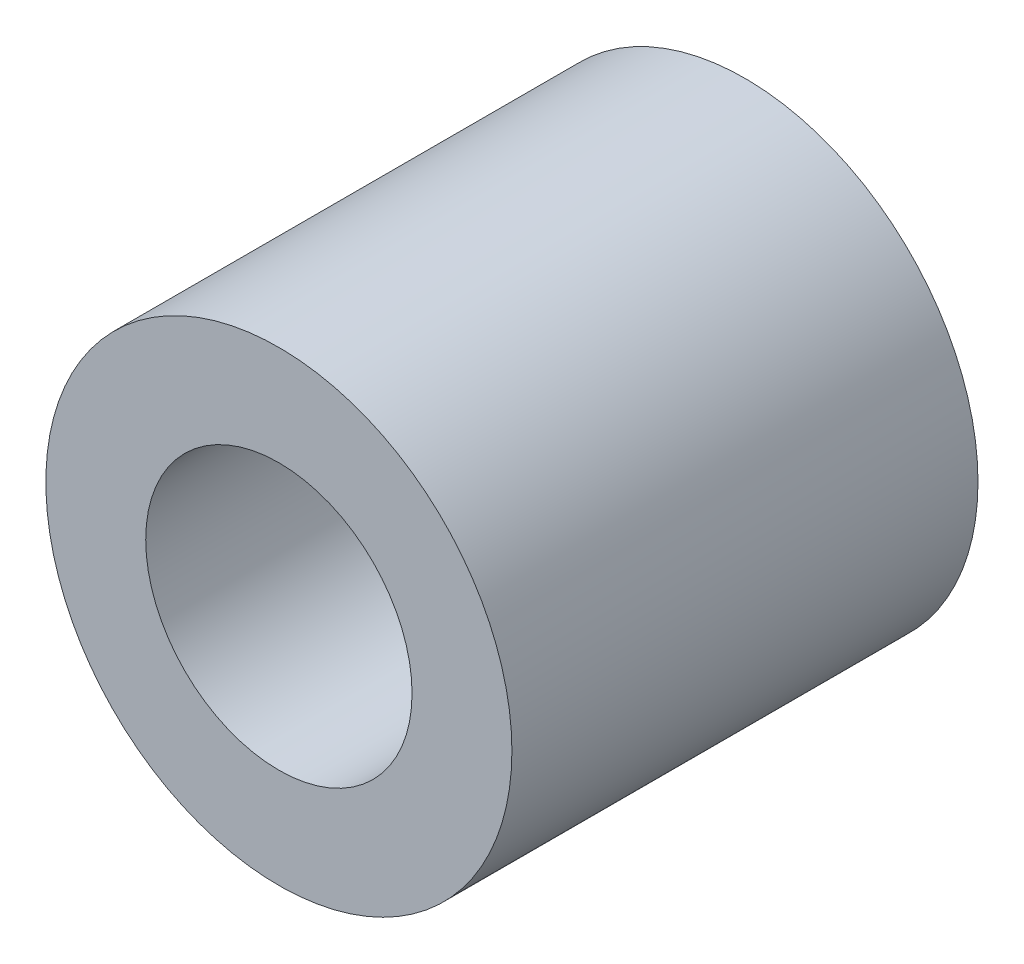
ISO-10303-21;
HEADER;
FILE_DESCRIPTION(('STEP AP214'),'2;1');
FILE_NAME('part.step','',(''),(''),'','','');
FILE_SCHEMA(('AUTOMOTIVE_DESIGN { 1 0 10303 214 1 1 1 1 }'));
ENDSEC;
DATA;
#1=APPLICATION_CONTEXT('core data for automotive mechanical design processes');
#2=APPLICATION_PROTOCOL_DEFINITION('international standard','automotive_design',2000,#1);
#3=PRODUCT_CONTEXT('',#1,'mechanical');
#4=PRODUCT('Part','Part','',(#3));
#5=PRODUCT_RELATED_PRODUCT_CATEGORY('part','',(#4));
#6=PRODUCT_DEFINITION_FORMATION('','',#4);
#7=PRODUCT_DEFINITION_CONTEXT('part definition',#1,'design');
#8=PRODUCT_DEFINITION('design','',#6,#7);
#9=PRODUCT_DEFINITION_SHAPE('','',#8);
#10=(LENGTH_UNIT() NAMED_UNIT(*) SI_UNIT(.MILLI.,.METRE.));
#11=(NAMED_UNIT(*) PLANE_ANGLE_UNIT() SI_UNIT($,.RADIAN.));
#12=(NAMED_UNIT(*) SI_UNIT($,.STERADIAN.) SOLID_ANGLE_UNIT());
#13=UNCERTAINTY_MEASURE_WITH_UNIT(LENGTH_MEASURE(1.E-05),#10,'distance_accuracy_value','');
#14=(GEOMETRIC_REPRESENTATION_CONTEXT(3) GLOBAL_UNCERTAINTY_ASSIGNED_CONTEXT((#13)) GLOBAL_UNIT_ASSIGNED_CONTEXT((#10,
#11,#12)) REPRESENTATION_CONTEXT('',''));
#15=CARTESIAN_POINT('',(0.,0.,0.));
#16=DIRECTION('',(0.,0.,1.));
#17=DIRECTION('',(1.,0.,0.));
#18=AXIS2_PLACEMENT_3D('',#15,#16,#17);
#19=CARTESIAN_POINT('',(-6.425,0.,0.));
#20=DIRECTION('',(0.,0.,1.));
#21=DIRECTION('',(1.,0.,0.));
#22=AXIS2_PLACEMENT_3D('',#19,#20,#21);
#23=CYLINDRICAL_SURFACE('',#22,2.);
#24=CARTESIAN_POINT('',(-6.425,0.,7.));
#25=DIRECTION('',(0.,0.,1.));
#26=DIRECTION('',(1.,0.,0.));
#27=AXIS2_PLACEMENT_3D('',#24,#25,#26);
#28=CIRCLE('',#27,2.);
#29=CARTESIAN_POINT('',(-4.425,0.,7.));
#30=VERTEX_POINT('',#29);
#31=EDGE_CURVE('E18',#30,#30,#28,.T.);
#32=ORIENTED_EDGE('',*,*,#31,.T.);
#33=EDGE_LOOP('',(#32));
#34=FACE_BOUND('',#33,.T.);
#35=CARTESIAN_POINT('',(-6.425,0.,0.));
#36=DIRECTION('',(0.,0.,1.));
#37=DIRECTION('',(1.,0.,0.));
#38=AXIS2_PLACEMENT_3D('',#35,#36,#37);
#39=CIRCLE('',#38,2.);
#40=CARTESIAN_POINT('',(-4.425,0.,0.));
#41=VERTEX_POINT('',#40);
#42=EDGE_CURVE('E27',#41,#41,#39,.T.);
#43=ORIENTED_EDGE('',*,*,#42,.F.);
#44=EDGE_LOOP('',(#43));
#45=FACE_BOUND('',#44,.T.);
#46=ADVANCED_FACE('F15',(#34,#45),#23,.F.);
#47=CARTESIAN_POINT('',(-6.425,0.,7.));
#48=DIRECTION('',(0.,0.,-1.));
#49=DIRECTION('',(-1.,0.,0.));
#50=AXIS2_PLACEMENT_3D('',#47,#48,#49);
#51=PLANE('',#50);
#52=ORIENTED_EDGE('',*,*,#31,.F.);
#53=EDGE_LOOP('',(#52));
#54=FACE_BOUND('',#53,.T.);
#55=CARTESIAN_POINT('',(-6.425,0.,7.));
#56=DIRECTION('',(0.,0.,1.));
#57=DIRECTION('',(1.,0.,0.));
#58=AXIS2_PLACEMENT_3D('',#55,#56,#57);
#59=CIRCLE('',#58,3.5);
#60=CARTESIAN_POINT('',(-2.925,0.,7.));
#61=VERTEX_POINT('',#60);
#62=EDGE_CURVE('E22',#61,#61,#59,.F.);
#63=ORIENTED_EDGE('',*,*,#62,.F.);
#64=EDGE_LOOP('',(#63));
#65=FACE_BOUND('',#64,.T.);
#66=ADVANCED_FACE('F37',(#54,#65),#51,.F.);
#67=CARTESIAN_POINT('',(-6.425,0.,0.));
#68=DIRECTION('',(0.,0.,-1.));
#69=DIRECTION('',(-1.,0.,0.));
#70=AXIS2_PLACEMENT_3D('',#67,#68,#69);
#71=PLANE('',#70);
#72=ORIENTED_EDGE('',*,*,#42,.T.);
#73=EDGE_LOOP('',(#72));
#74=FACE_BOUND('',#73,.T.);
#75=CARTESIAN_POINT('',(-6.425,0.,0.));
#76=DIRECTION('',(0.,0.,1.));
#77=DIRECTION('',(1.,0.,0.));
#78=AXIS2_PLACEMENT_3D('',#75,#76,#77);
#79=CIRCLE('',#78,3.5);
#80=CARTESIAN_POINT('',(-2.925,0.,0.));
#81=VERTEX_POINT('',#80);
#82=EDGE_CURVE('E10',#81,#81,#79,.T.);
#83=ORIENTED_EDGE('',*,*,#82,.F.);
#84=EDGE_LOOP('',(#83));
#85=FACE_BOUND('',#84,.T.);
#86=ADVANCED_FACE('F40',(#74,#85),#71,.T.);
#87=CARTESIAN_POINT('',(-6.425,0.,0.));
#88=DIRECTION('',(0.,0.,1.));
#89=DIRECTION('',(1.,0.,0.));
#90=AXIS2_PLACEMENT_3D('',#87,#88,#89);
#91=CYLINDRICAL_SURFACE('',#90,3.5);
#92=ORIENTED_EDGE('',*,*,#82,.T.);
#93=EDGE_LOOP('',(#92));
#94=FACE_BOUND('',#93,.T.);
#95=ORIENTED_EDGE('',*,*,#62,.T.);
#96=EDGE_LOOP('',(#95));
#97=FACE_BOUND('',#96,.T.);
#98=ADVANCED_FACE('F43',(#94,#97),#91,.T.);
#99=CLOSED_SHELL('',(#46,#66,#86,#98));
#100=MANIFOLD_SOLID_BREP('B1',#99);
#101=ADVANCED_BREP_SHAPE_REPRESENTATION('',(#18,#100),#14);
#102=SHAPE_DEFINITION_REPRESENTATION(#9,#101);
ENDSEC;
END-ISO-10303-21;
